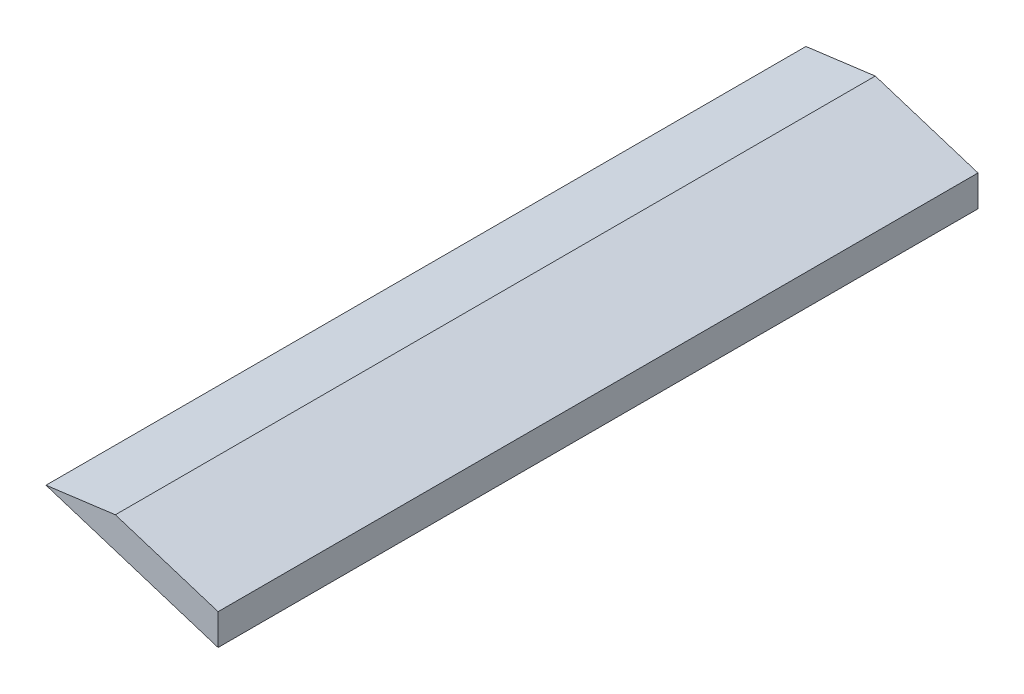
ISO-10303-21;
HEADER;
FILE_DESCRIPTION(('STEP AP214'),'2;1');
FILE_NAME('part.step','',(''),(''),'','','');
FILE_SCHEMA(('AUTOMOTIVE_DESIGN { 1 0 10303 214 1 1 1 1 }'));
ENDSEC;
DATA;
#1=APPLICATION_CONTEXT('core data for automotive mechanical design processes');
#2=APPLICATION_PROTOCOL_DEFINITION('international standard','automotive_design',2000,#1);
#3=PRODUCT_CONTEXT('',#1,'mechanical');
#4=PRODUCT('Part','Part','',(#3));
#5=PRODUCT_RELATED_PRODUCT_CATEGORY('part','',(#4));
#6=PRODUCT_DEFINITION_FORMATION('','',#4);
#7=PRODUCT_DEFINITION_CONTEXT('part definition',#1,'design');
#8=PRODUCT_DEFINITION('design','',#6,#7);
#9=PRODUCT_DEFINITION_SHAPE('','',#8);
#10=(LENGTH_UNIT() NAMED_UNIT(*) SI_UNIT(.MILLI.,.METRE.));
#11=(NAMED_UNIT(*) PLANE_ANGLE_UNIT() SI_UNIT($,.RADIAN.));
#12=(NAMED_UNIT(*) SI_UNIT($,.STERADIAN.) SOLID_ANGLE_UNIT());
#13=UNCERTAINTY_MEASURE_WITH_UNIT(LENGTH_MEASURE(1.E-05),#10,'distance_accuracy_value','');
#14=(GEOMETRIC_REPRESENTATION_CONTEXT(3) GLOBAL_UNCERTAINTY_ASSIGNED_CONTEXT((#13)) GLOBAL_UNIT_ASSIGNED_CONTEXT((#10,
#11,#12)) REPRESENTATION_CONTEXT('',''));
#15=CARTESIAN_POINT('',(0.,0.,0.));
#16=DIRECTION('',(0.,0.,1.));
#17=DIRECTION('',(1.,0.,0.));
#18=AXIS2_PLACEMENT_3D('',#15,#16,#17);
#19=CARTESIAN_POINT('',(259.099999164795,-276.931424675937,95.5908974367671));
#20=DIRECTION('',(-0.302086687513186,-0.953280458851072,0.));
#21=DIRECTION('',(0.953280458851072,-0.302086687513186,0.));
#22=AXIS2_PLACEMENT_3D('',#19,#20,#21);
#23=PLANE('',#22);
#24=DIRECTION('',(-0.953280458851072,0.302086687513186,0.));
#25=VECTOR('',#24,1.);
#26=CARTESIAN_POINT('',(259.099999164795,-276.931424675937,77.));
#27=LINE('',#26,#25);
#28=CARTESIAN_POINT('',(259.099999164795,-276.931424675937,77.));
#29=VERTEX_POINT('',#28);
#30=CARTESIAN_POINT('',(248.691196920224,-273.63296139386,77.));
#31=VERTEX_POINT('',#30);
#32=EDGE_CURVE('E83',#29,#31,#27,.T.);
#33=ORIENTED_EDGE('',*,*,#32,.F.);
#34=DIRECTION('',(0.,0.,-1.));
#35=VECTOR('',#34,1.);
#36=CARTESIAN_POINT('',(259.099999164795,-276.931424675937,95.5908974367671));
#37=LINE('',#36,#35);
#38=CARTESIAN_POINT('',(259.099999164795,-276.931424675937,0.));
#39=VERTEX_POINT('',#38);
#40=EDGE_CURVE('E37',#29,#39,#37,.T.);
#41=ORIENTED_EDGE('',*,*,#40,.T.);
#42=DIRECTION('',(-0.953280458851072,0.302086687513186,0.));
#43=VECTOR('',#42,1.);
#44=CARTESIAN_POINT('',(259.099999164795,-276.931424675937,0.));
#45=LINE('',#44,#43);
#46=CARTESIAN_POINT('',(248.691196920224,-273.63296139386,0.));
#47=VERTEX_POINT('',#46);
#48=EDGE_CURVE('E81',#39,#47,#45,.T.);
#49=ORIENTED_EDGE('',*,*,#48,.T.);
#50=DIRECTION('',(0.,0.,-1.));
#51=VECTOR('',#50,1.);
#52=CARTESIAN_POINT('',(248.691196920224,-273.63296139386,95.5908974367671));
#53=LINE('',#52,#51);
#54=EDGE_CURVE('E72',#31,#47,#53,.T.);
#55=ORIENTED_EDGE('',*,*,#54,.F.);
#56=EDGE_LOOP('',(#33,#41,#49,#55));
#57=FACE_BOUND('',#56,.T.);
#58=ADVANCED_FACE('F33',(#57),#23,.F.);
#59=CARTESIAN_POINT('',(241.662192080147,-274.552555625765,95.5908974367671));
#60=DIRECTION('',(0.129723044275575,-0.991550266897184,0.));
#61=DIRECTION('',(0.991550266897184,0.129723044275575,0.));
#62=AXIS2_PLACEMENT_3D('',#59,#60,#61);
#63=PLANE('',#62);
#64=DIRECTION('',(-0.991550266897184,-0.129723044275575,0.));
#65=VECTOR('',#64,1.);
#66=CARTESIAN_POINT('',(241.662192080147,-274.552555625765,77.));
#67=LINE('',#66,#65);
#68=CARTESIAN_POINT('',(241.662192080147,-274.552555625765,77.));
#69=VERTEX_POINT('',#68);
#70=EDGE_CURVE('E42',#31,#69,#67,.T.);
#71=ORIENTED_EDGE('',*,*,#70,.F.);
#72=ORIENTED_EDGE('',*,*,#54,.T.);
#73=DIRECTION('',(-0.991550266897184,-0.129723044275575,0.));
#74=VECTOR('',#73,1.);
#75=CARTESIAN_POINT('',(241.662192080147,-274.552555625765,0.));
#76=LINE('',#75,#74);
#77=CARTESIAN_POINT('',(241.662192080147,-274.552555625765,0.));
#78=VERTEX_POINT('',#77);
#79=EDGE_CURVE('E93',#47,#78,#76,.T.);
#80=ORIENTED_EDGE('',*,*,#79,.T.);
#81=DIRECTION('',(0.,0.,-1.));
#82=VECTOR('',#81,1.);
#83=CARTESIAN_POINT('',(241.662192080147,-274.552555625765,95.5908974367671));
#84=LINE('',#83,#82);
#85=EDGE_CURVE('E102',#69,#78,#84,.T.);
#86=ORIENTED_EDGE('',*,*,#85,.F.);
#87=EDGE_LOOP('',(#71,#72,#80,#86));
#88=FACE_BOUND('',#87,.T.);
#89=ADVANCED_FACE('F106',(#88),#63,.F.);
#90=CARTESIAN_POINT('',(259.099998605795,-280.078452188438,95.5908974367671));
#91=DIRECTION('',(0.302086687513184,0.953280458851073,0.));
#92=DIRECTION('',(-0.953280458851073,0.302086687513184,0.));
#93=AXIS2_PLACEMENT_3D('',#90,#91,#92);
#94=PLANE('',#93);
#95=DIRECTION('',(0.953280458851073,-0.302086687513184,0.));
#96=VECTOR('',#95,1.);
#97=CARTESIAN_POINT('',(259.099998605795,-280.078452188438,77.));
#98=LINE('',#97,#96);
#99=CARTESIAN_POINT('',(259.099998605795,-280.078452188438,77.));
#100=VERTEX_POINT('',#99);
#101=EDGE_CURVE('E11',#69,#100,#98,.T.);
#102=ORIENTED_EDGE('',*,*,#101,.F.);
#103=ORIENTED_EDGE('',*,*,#85,.T.);
#104=DIRECTION('',(0.953280458851073,-0.302086687513184,0.));
#105=VECTOR('',#104,1.);
#106=CARTESIAN_POINT('',(259.099998605795,-280.078452188438,0.));
#107=LINE('',#106,#105);
#108=CARTESIAN_POINT('',(259.099998605795,-280.078452188438,0.));
#109=VERTEX_POINT('',#108);
#110=EDGE_CURVE('E103',#78,#109,#107,.T.);
#111=ORIENTED_EDGE('',*,*,#110,.T.);
#112=DIRECTION('',(0.,0.,-1.));
#113=VECTOR('',#112,1.);
#114=CARTESIAN_POINT('',(259.099998605795,-280.078452188438,95.5908974367671));
#115=LINE('',#114,#113);
#116=EDGE_CURVE('E55',#100,#109,#115,.T.);
#117=ORIENTED_EDGE('',*,*,#116,.F.);
#118=EDGE_LOOP('',(#102,#103,#111,#117));
#119=FACE_BOUND('',#118,.T.);
#120=ADVANCED_FACE('F105',(#119),#94,.F.);
#121=CARTESIAN_POINT('',(259.099999164795,-276.931424675937,95.5908974367671));
#122=DIRECTION('',(-0.999999999999984,1.77628168921216E-07,0.));
#123=DIRECTION('',(-1.77628168921216E-07,-0.999999999999984,0.));
#124=AXIS2_PLACEMENT_3D('',#121,#122,#123);
#125=PLANE('',#124);
#126=DIRECTION('',(1.77628168921216E-07,0.999999999999984,0.));
#127=VECTOR('',#126,1.);
#128=CARTESIAN_POINT('',(259.099999164795,-276.931424675937,77.));
#129=LINE('',#128,#127);
#130=EDGE_CURVE('E90',#100,#29,#129,.T.);
#131=ORIENTED_EDGE('',*,*,#130,.F.);
#132=ORIENTED_EDGE('',*,*,#116,.T.);
#133=DIRECTION('',(1.77628168921216E-07,0.999999999999984,0.));
#134=VECTOR('',#133,1.);
#135=CARTESIAN_POINT('',(259.099999164795,-276.931424675937,0.));
#136=LINE('',#135,#134);
#137=EDGE_CURVE('E86',#109,#39,#136,.T.);
#138=ORIENTED_EDGE('',*,*,#137,.T.);
#139=ORIENTED_EDGE('',*,*,#40,.F.);
#140=EDGE_LOOP('',(#131,#132,#138,#139));
#141=FACE_BOUND('',#140,.T.);
#142=ADVANCED_FACE('F87',(#141),#125,.F.);
#143=CARTESIAN_POINT('',(0.,0.,0.));
#144=DIRECTION('',(0.,0.,1.));
#145=DIRECTION('',(1.,0.,0.));
#146=AXIS2_PLACEMENT_3D('',#143,#144,#145);
#147=PLANE('',#146);
#148=ORIENTED_EDGE('',*,*,#48,.F.);
#149=ORIENTED_EDGE('',*,*,#137,.F.);
#150=ORIENTED_EDGE('',*,*,#110,.F.);
#151=ORIENTED_EDGE('',*,*,#79,.F.);
#152=EDGE_LOOP('',(#148,#149,#150,#151));
#153=FACE_BOUND('',#152,.T.);
#154=ADVANCED_FACE('F92',(#153),#147,.F.);
#155=CARTESIAN_POINT('',(0.,0.,77.));
#156=DIRECTION('',(0.,0.,1.));
#157=DIRECTION('',(1.,0.,0.));
#158=AXIS2_PLACEMENT_3D('',#155,#156,#157);
#159=PLANE('',#158);
#160=ORIENTED_EDGE('',*,*,#130,.T.);
#161=ORIENTED_EDGE('',*,*,#32,.T.);
#162=ORIENTED_EDGE('',*,*,#70,.T.);
#163=ORIENTED_EDGE('',*,*,#101,.T.);
#164=EDGE_LOOP('',(#160,#161,#162,#163));
#165=FACE_BOUND('',#164,.T.);
#166=ADVANCED_FACE('F35',(#165),#159,.T.);
#167=CLOSED_SHELL('',(#58,#89,#120,#142,#154,#166));
#168=MANIFOLD_SOLID_BREP('B2',#167);
#169=ADVANCED_BREP_SHAPE_REPRESENTATION('',(#18,#168),#14);
#170=SHAPE_DEFINITION_REPRESENTATION(#9,#169);
ENDSEC;
END-ISO-10303-21;
